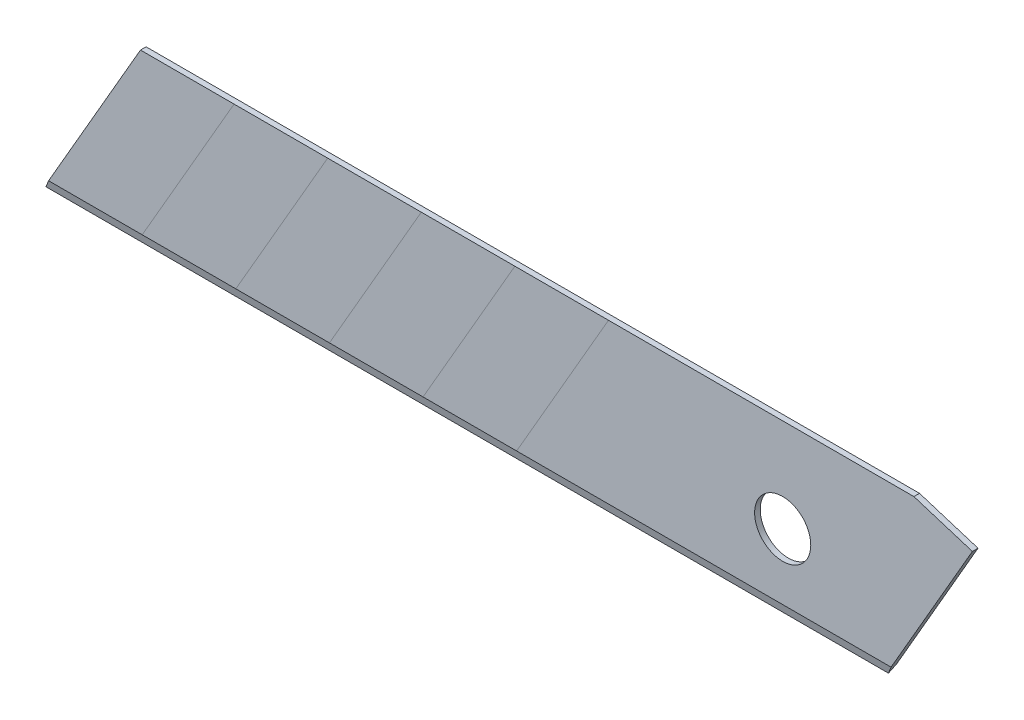
ISO-10303-21;
HEADER;
FILE_DESCRIPTION(('STEP AP214'),'2;1');
FILE_NAME('part.step','',(''),(''),'','','');
FILE_SCHEMA(('AUTOMOTIVE_DESIGN { 1 0 10303 214 1 1 1 1 }'));
ENDSEC;
DATA;
#1=APPLICATION_CONTEXT('core data for automotive mechanical design processes');
#2=APPLICATION_PROTOCOL_DEFINITION('international standard','automotive_design',2000,#1);
#3=PRODUCT_CONTEXT('',#1,'mechanical');
#4=PRODUCT('Part','Part','',(#3));
#5=PRODUCT_RELATED_PRODUCT_CATEGORY('part','',(#4));
#6=PRODUCT_DEFINITION_FORMATION('','',#4);
#7=PRODUCT_DEFINITION_CONTEXT('part definition',#1,'design');
#8=PRODUCT_DEFINITION('design','',#6,#7);
#9=PRODUCT_DEFINITION_SHAPE('','',#8);
#10=(LENGTH_UNIT() NAMED_UNIT(*) SI_UNIT(.MILLI.,.METRE.));
#11=(NAMED_UNIT(*) PLANE_ANGLE_UNIT() SI_UNIT($,.RADIAN.));
#12=(NAMED_UNIT(*) SI_UNIT($,.STERADIAN.) SOLID_ANGLE_UNIT());
#13=UNCERTAINTY_MEASURE_WITH_UNIT(LENGTH_MEASURE(1.E-05),#10,'distance_accuracy_value','');
#14=(GEOMETRIC_REPRESENTATION_CONTEXT(3) GLOBAL_UNCERTAINTY_ASSIGNED_CONTEXT((#13)) GLOBAL_UNIT_ASSIGNED_CONTEXT((#10,
#11,#12)) REPRESENTATION_CONTEXT('',''));
#15=CARTESIAN_POINT('',(0.,0.,0.));
#16=DIRECTION('',(0.,0.,1.));
#17=DIRECTION('',(1.,0.,0.));
#18=AXIS2_PLACEMENT_3D('',#15,#16,#17);
#19=CARTESIAN_POINT('',(-70.7283011839796,15.6445712955346,-0.15));
#20=DIRECTION('',(0.,0.,1.));
#21=DIRECTION('',(1.,0.,0.));
#22=AXIS2_PLACEMENT_3D('',#19,#20,#21);
#23=PLANE('',#22);
#24=DIRECTION('',(0.499999999999999,0.866025403784439,0.));
#25=VECTOR('',#24,1.);
#26=CARTESIAN_POINT('',(-23.8007264018009,-11.4490766373724,-0.15));
#27=LINE('',#26,#25);
#28=CARTESIAN_POINT('',(-19.211324865405,-3.49999999999999,-0.15));
#29=VERTEX_POINT('',#28);
#30=CARTESIAN_POINT('',(-14.3038475772932,5.,-0.15));
#31=VERTEX_POINT('',#30);
#32=EDGE_CURVE('E59',#29,#31,#27,.T.);
#33=ORIENTED_EDGE('',*,*,#32,.F.);
#34=DIRECTION('',(-1.,0.,0.));
#35=VECTOR('',#34,1.);
#36=CARTESIAN_POINT('',(13.,-3.5,-0.15));
#37=LINE('',#36,#35);
#38=CARTESIAN_POINT('',(-24.211324865405,-3.49999999999999,-0.15));
#39=VERTEX_POINT('',#38);
#40=EDGE_CURVE('E384',#29,#39,#37,.T.);
#41=ORIENTED_EDGE('',*,*,#40,.T.);
#42=DIRECTION('',(0.499999999999999,0.866025403784439,0.));
#43=VECTOR('',#42,1.);
#44=CARTESIAN_POINT('',(-27.5507264018009,-9.28401312791136,-0.15));
#45=LINE('',#44,#43);
#46=CARTESIAN_POINT('',(-19.3038475772932,5.,-0.15));
#47=VERTEX_POINT('',#46);
#48=EDGE_CURVE('E222',#39,#47,#45,.T.);
#49=ORIENTED_EDGE('',*,*,#48,.T.);
#50=DIRECTION('',(-1.,0.,0.));
#51=VECTOR('',#50,1.);
#52=CARTESIAN_POINT('',(-65.9878692661466,5.,-0.15));
#53=LINE('',#52,#51);
#54=EDGE_CURVE('E325',#31,#47,#53,.T.);
#55=ORIENTED_EDGE('',*,*,#54,.F.);
#56=EDGE_LOOP('',(#33,#41,#49,#55));
#57=FACE_BOUND('',#56,.T.);
#58=ADVANCED_FACE('F50',(#57),#23,.F.);
#59=ORIENTED_EDGE('',*,*,#48,.F.);
#60=CARTESIAN_POINT('',(-29.211324865405,-3.49999999999999,-0.15));
#61=VERTEX_POINT('',#60);
#62=EDGE_CURVE('E390',#39,#61,#37,.T.);
#63=ORIENTED_EDGE('',*,*,#62,.T.);
#64=DIRECTION('',(0.499999999999999,0.866025403784439,0.));
#65=VECTOR('',#64,1.);
#66=CARTESIAN_POINT('',(-31.3007264018009,-7.11894961845024,-0.15));
#67=LINE('',#66,#65);
#68=CARTESIAN_POINT('',(-24.3038475772932,5.,-0.15));
#69=VERTEX_POINT('',#68);
#70=EDGE_CURVE('E218',#61,#69,#67,.T.);
#71=ORIENTED_EDGE('',*,*,#70,.T.);
#72=EDGE_CURVE('E332',#47,#69,#53,.T.);
#73=ORIENTED_EDGE('',*,*,#72,.F.);
#74=EDGE_LOOP('',(#59,#63,#71,#73));
#75=FACE_BOUND('',#74,.T.);
#76=ADVANCED_FACE('F425',(#75),#23,.F.);
#77=ORIENTED_EDGE('',*,*,#70,.F.);
#78=CARTESIAN_POINT('',(-34.211324865405,-3.5,-0.15));
#79=VERTEX_POINT('',#78);
#80=EDGE_CURVE('E393',#61,#79,#37,.T.);
#81=ORIENTED_EDGE('',*,*,#80,.T.);
#82=DIRECTION('',(0.499999999999999,0.866025403784439,0.));
#83=VECTOR('',#82,1.);
#84=CARTESIAN_POINT('',(-35.050726401801,-4.95388610898914,-0.15));
#85=LINE('',#84,#83);
#86=CARTESIAN_POINT('',(-29.3038475772932,5.,-0.15));
#87=VERTEX_POINT('',#86);
#88=EDGE_CURVE('E214',#79,#87,#85,.T.);
#89=ORIENTED_EDGE('',*,*,#88,.T.);
#90=EDGE_CURVE('E335',#69,#87,#53,.T.);
#91=ORIENTED_EDGE('',*,*,#90,.F.);
#92=EDGE_LOOP('',(#77,#81,#89,#91));
#93=FACE_BOUND('',#92,.T.);
#94=ADVANCED_FACE('F419',(#93),#23,.F.);
#95=ORIENTED_EDGE('',*,*,#88,.F.);
#96=CARTESIAN_POINT('',(-39.2113248654052,-3.5,-0.15));
#97=VERTEX_POINT('',#96);
#98=EDGE_CURVE('E387',#79,#97,#37,.T.);
#99=ORIENTED_EDGE('',*,*,#98,.T.);
#100=DIRECTION('',(0.499999999999999,0.866025403784439,0.));
#101=VECTOR('',#100,1.);
#102=CARTESIAN_POINT('',(-38.800726401801,-2.78882259952805,-0.15));
#103=LINE('',#102,#101);
#104=CARTESIAN_POINT('',(-34.3038475772934,5.,-0.15));
#105=VERTEX_POINT('',#104);
#106=EDGE_CURVE('E210',#97,#105,#103,.T.);
#107=ORIENTED_EDGE('',*,*,#106,.T.);
#108=EDGE_CURVE('E329',#87,#105,#53,.T.);
#109=ORIENTED_EDGE('',*,*,#108,.F.);
#110=EDGE_LOOP('',(#95,#99,#107,#109));
#111=FACE_BOUND('',#110,.T.);
#112=ADVANCED_FACE('F415',(#111),#23,.F.);
#113=CARTESIAN_POINT('',(-14.211324865405,-3.5,-0.15));
#114=VERTEX_POINT('',#113);
#115=EDGE_CURVE('E382',#114,#29,#37,.T.);
#116=ORIENTED_EDGE('',*,*,#115,.T.);
#117=ORIENTED_EDGE('',*,*,#32,.T.);
#118=CARTESIAN_POINT('',(-9.30384757729341,5.,-0.15));
#119=VERTEX_POINT('',#118);
#120=EDGE_CURVE('E323',#119,#31,#53,.T.);
#121=ORIENTED_EDGE('',*,*,#120,.F.);
#122=DIRECTION('',(0.49999999999998,0.86602540378445,0.));
#123=VECTOR('',#122,1.);
#124=CARTESIAN_POINT('',(-20.0507264018001,-13.6141401468326,-0.15));
#125=LINE('',#124,#123);
#126=EDGE_CURVE('E207',#114,#119,#125,.T.);
#127=ORIENTED_EDGE('',*,*,#126,.F.);
#128=EDGE_LOOP('',(#116,#117,#121,#127));
#129=FACE_BOUND('',#128,.T.);
#130=ADVANCED_FACE('F429',(#129),#23,.F.);
#131=CARTESIAN_POINT('',(-70.7283011839796,15.6445712955346,0.15));
#132=DIRECTION('',(0.,0.,1.));
#133=DIRECTION('',(1.,0.,0.));
#134=AXIS2_PLACEMENT_3D('',#131,#132,#133);
#135=PLANE('',#134);
#136=DIRECTION('',(-1.,0.,0.));
#137=VECTOR('',#136,1.);
#138=CARTESIAN_POINT('',(13.,-3.5,0.15));
#139=LINE('',#138,#137);
#140=CARTESIAN_POINT('',(-19.2113248654052,-3.49999999999999,0.15));
#141=VERTEX_POINT('',#140);
#142=CARTESIAN_POINT('',(-24.2113248654052,-3.49999999999999,0.15));
#143=VERTEX_POINT('',#142);
#144=EDGE_CURVE('E367',#141,#143,#139,.T.);
#145=ORIENTED_EDGE('',*,*,#144,.F.);
#146=DIRECTION('',(0.5,0.866025403784439,0.));
#147=VECTOR('',#146,1.);
#148=CARTESIAN_POINT('',(-23.8007264018011,-11.4490766373724,0.15));
#149=LINE('',#148,#147);
#150=CARTESIAN_POINT('',(-14.3038475772934,5.,0.15));
#151=VERTEX_POINT('',#150);
#152=EDGE_CURVE('E204',#141,#151,#149,.T.);
#153=ORIENTED_EDGE('',*,*,#152,.T.);
#154=DIRECTION('',(-1.,0.,0.));
#155=VECTOR('',#154,1.);
#156=CARTESIAN_POINT('',(-65.9878692661466,5.,0.15));
#157=LINE('',#156,#155);
#158=CARTESIAN_POINT('',(-19.3038475772934,5.,0.15));
#159=VERTEX_POINT('',#158);
#160=EDGE_CURVE('E297',#151,#159,#157,.T.);
#161=ORIENTED_EDGE('',*,*,#160,.T.);
#162=DIRECTION('',(0.500000000000001,0.866025403784438,0.));
#163=VECTOR('',#162,1.);
#164=CARTESIAN_POINT('',(-27.5507264018012,-9.28401312791132,0.15));
#165=LINE('',#164,#163);
#166=EDGE_CURVE('E200',#143,#159,#165,.T.);
#167=ORIENTED_EDGE('',*,*,#166,.F.);
#168=EDGE_LOOP('',(#145,#153,#161,#167));
#169=FACE_BOUND('',#168,.T.);
#170=ADVANCED_FACE('F456',(#169),#135,.T.);
#171=CARTESIAN_POINT('',(-29.2113248654052,-3.49999999999999,0.15));
#172=VERTEX_POINT('',#171);
#173=EDGE_CURVE('E373',#143,#172,#139,.T.);
#174=ORIENTED_EDGE('',*,*,#173,.F.);
#175=ORIENTED_EDGE('',*,*,#166,.T.);
#176=CARTESIAN_POINT('',(-24.3038475772934,5.,0.15));
#177=VERTEX_POINT('',#176);
#178=EDGE_CURVE('E303',#159,#177,#157,.T.);
#179=ORIENTED_EDGE('',*,*,#178,.T.);
#180=DIRECTION('',(0.500000000000001,0.866025403784438,0.));
#181=VECTOR('',#180,1.);
#182=CARTESIAN_POINT('',(-31.3007264018011,-7.11894961845023,0.15));
#183=LINE('',#182,#181);
#184=EDGE_CURVE('E191',#172,#177,#183,.T.);
#185=ORIENTED_EDGE('',*,*,#184,.F.);
#186=EDGE_LOOP('',(#174,#175,#179,#185));
#187=FACE_BOUND('',#186,.T.);
#188=ADVANCED_FACE('F461',(#187),#135,.T.);
#189=CARTESIAN_POINT('',(-34.2113248654052,-3.5,0.15));
#190=VERTEX_POINT('',#189);
#191=EDGE_CURVE('E171',#172,#190,#139,.T.);
#192=ORIENTED_EDGE('',*,*,#191,.F.);
#193=ORIENTED_EDGE('',*,*,#184,.T.);
#194=CARTESIAN_POINT('',(-29.3038475772934,5.,0.15));
#195=VERTEX_POINT('',#194);
#196=EDGE_CURVE('E306',#177,#195,#157,.T.);
#197=ORIENTED_EDGE('',*,*,#196,.T.);
#198=DIRECTION('',(0.5,0.866025403784439,0.));
#199=VECTOR('',#198,1.);
#200=CARTESIAN_POINT('',(-35.0507264018011,-4.95388610898912,0.15));
#201=LINE('',#200,#199);
#202=EDGE_CURVE('E184',#190,#195,#201,.T.);
#203=ORIENTED_EDGE('',*,*,#202,.F.);
#204=EDGE_LOOP('',(#192,#193,#197,#203));
#205=FACE_BOUND('',#204,.T.);
#206=ADVANCED_FACE('F463',(#205),#135,.T.);
#207=CARTESIAN_POINT('',(-39.2113248654052,-3.5,0.15));
#208=VERTEX_POINT('',#207);
#209=EDGE_CURVE('E168',#190,#208,#139,.T.);
#210=ORIENTED_EDGE('',*,*,#209,.F.);
#211=ORIENTED_EDGE('',*,*,#202,.T.);
#212=CARTESIAN_POINT('',(-34.3038475772934,5.,0.15));
#213=VERTEX_POINT('',#212);
#214=EDGE_CURVE('E182',#195,#213,#157,.T.);
#215=ORIENTED_EDGE('',*,*,#214,.T.);
#216=DIRECTION('',(0.5,0.866025403784439,0.));
#217=VECTOR('',#216,1.);
#218=CARTESIAN_POINT('',(-38.8007264018011,-2.78882259952802,0.15));
#219=LINE('',#218,#217);
#220=EDGE_CURVE('E163',#208,#213,#219,.T.);
#221=ORIENTED_EDGE('',*,*,#220,.F.);
#222=EDGE_LOOP('',(#210,#211,#215,#221));
#223=FACE_BOUND('',#222,.T.);
#224=ADVANCED_FACE('F180',(#223),#135,.T.);
#225=ORIENTED_EDGE('',*,*,#152,.F.);
#226=CARTESIAN_POINT('',(-14.2113248654052,-3.5,0.15));
#227=VERTEX_POINT('',#226);
#228=EDGE_CURVE('E178',#227,#141,#139,.T.);
#229=ORIENTED_EDGE('',*,*,#228,.F.);
#230=DIRECTION('',(0.5,0.866025403784438,0.));
#231=VECTOR('',#230,1.);
#232=CARTESIAN_POINT('',(-20.0507264018012,-13.6141401468335,0.15));
#233=LINE('',#232,#231);
#234=CARTESIAN_POINT('',(-9.30384757729341,5.,0.15));
#235=VERTEX_POINT('',#234);
#236=EDGE_CURVE('E185',#227,#235,#233,.T.);
#237=ORIENTED_EDGE('',*,*,#236,.T.);
#238=EDGE_CURVE('E295',#235,#151,#157,.T.);
#239=ORIENTED_EDGE('',*,*,#238,.T.);
#240=EDGE_LOOP('',(#225,#229,#237,#239));
#241=FACE_BOUND('',#240,.T.);
#242=ADVANCED_FACE('F452',(#241),#135,.T.);
#243=ORIENTED_EDGE('',*,*,#236,.F.);
#244=CARTESIAN_POINT('',(5.78867513459481,-3.5,0.15));
#245=VERTEX_POINT('',#244);
#246=EDGE_CURVE('E362',#245,#227,#139,.T.);
#247=ORIENTED_EDGE('',*,*,#246,.F.);
#248=DIRECTION('',(0.499999999999998,0.86602540378444,0.));
#249=VECTOR('',#248,1.);
#250=CARTESIAN_POINT('',(5.5,-4.,0.15));
#251=LINE('',#250,#249);
#252=CARTESIAN_POINT('',(10.1326672819298,4.02401510686452,0.15));
#253=VERTEX_POINT('',#252);
#254=EDGE_CURVE('E314',#245,#253,#251,.T.);
#255=ORIENTED_EDGE('',*,*,#254,.T.);
#256=DIRECTION('',(-0.954490474813964,0.298241401367104,0.));
#257=VECTOR('',#256,1.);
#258=CARTESIAN_POINT('',(7.00912950417686,5.,0.15));
#259=LINE('',#258,#257);
#260=CARTESIAN_POINT('',(7.00912950417686,5.,0.15));
#261=VERTEX_POINT('',#260);
#262=EDGE_CURVE('E311',#253,#261,#259,.T.);
#263=ORIENTED_EDGE('',*,*,#262,.T.);
#264=EDGE_CURVE('E290',#261,#235,#157,.T.);
#265=ORIENTED_EDGE('',*,*,#264,.T.);
#266=EDGE_LOOP('',(#243,#247,#255,#263,#265));
#267=FACE_BOUND('',#266,.T.);
#268=CARTESIAN_POINT('',(0.,0.,0.15));
#269=DIRECTION('',(0.,0.,1.));
#270=DIRECTION('',(1.,0.,0.));
#271=AXIS2_PLACEMENT_3D('',#268,#269,#270);
#272=CIRCLE('',#271,1.5);
#273=CARTESIAN_POINT('',(1.5,0.,0.15));
#274=VERTEX_POINT('',#273);
#275=EDGE_CURVE('E348',#274,#274,#272,.T.);
#276=ORIENTED_EDGE('',*,*,#275,.F.);
#277=EDGE_LOOP('',(#276));
#278=FACE_BOUND('',#277,.T.);
#279=ADVANCED_FACE('F445',(#267,#278),#135,.T.);
#280=CARTESIAN_POINT('',(0.,0.,-0.15));
#281=DIRECTION('',(0.,0.,1.));
#282=DIRECTION('',(1.,0.,0.));
#283=AXIS2_PLACEMENT_3D('',#280,#281,#282);
#284=CIRCLE('',#283,1.5);
#285=CARTESIAN_POINT('',(1.5,0.,-0.15));
#286=VERTEX_POINT('',#285);
#287=EDGE_CURVE('E353',#286,#286,#284,.T.);
#288=ORIENTED_EDGE('',*,*,#287,.T.);
#289=EDGE_LOOP('',(#288));
#290=FACE_BOUND('',#289,.T.);
#291=CARTESIAN_POINT('',(5.78867513459481,-3.5,-0.15));
#292=VERTEX_POINT('',#291);
#293=EDGE_CURVE('E176',#292,#114,#37,.T.);
#294=ORIENTED_EDGE('',*,*,#293,.T.);
#295=ORIENTED_EDGE('',*,*,#126,.T.);
#296=CARTESIAN_POINT('',(7.00912950417686,5.,-0.15));
#297=VERTEX_POINT('',#296);
#298=EDGE_CURVE('E318',#297,#119,#53,.T.);
#299=ORIENTED_EDGE('',*,*,#298,.F.);
#300=DIRECTION('',(-0.954490474813964,0.298241401367104,0.));
#301=VECTOR('',#300,1.);
#302=CARTESIAN_POINT('',(7.00912950417686,5.,-0.15));
#303=LINE('',#302,#301);
#304=CARTESIAN_POINT('',(10.1326672819298,4.02401510686452,-0.15));
#305=VERTEX_POINT('',#304);
#306=EDGE_CURVE('E341',#305,#297,#303,.T.);
#307=ORIENTED_EDGE('',*,*,#306,.F.);
#308=DIRECTION('',(0.499999999999998,0.86602540378444,0.));
#309=VECTOR('',#308,1.);
#310=CARTESIAN_POINT('',(5.5,-4.,-0.15));
#311=LINE('',#310,#309);
#312=EDGE_CURVE('E344',#292,#305,#311,.T.);
#313=ORIENTED_EDGE('',*,*,#312,.F.);
#314=EDGE_LOOP('',(#294,#295,#299,#307,#313));
#315=FACE_BOUND('',#314,.T.);
#316=ADVANCED_FACE('F433',(#290,#315),#23,.F.);
#317=CARTESIAN_POINT('',(5.5,-4.,0.15));
#318=DIRECTION('',(-0.86602540378444,0.499999999999998,0.));
#319=DIRECTION('',(-0.499999999999998,-0.86602540378444,0.));
#320=AXIS2_PLACEMENT_3D('',#317,#318,#319);
#321=PLANE('',#320);
#322=DIRECTION('',(-0.483933918495825,-0.83819813434067,0.251459440302201));
#323=VECTOR('',#322,1.);
#324=CARTESIAN_POINT('',(5.48174653715677,-4.03161592505855,0.00948477751756444));
#325=LINE('',#324,#323);
#326=CARTESIAN_POINT('',(5.5,-4.,0.));
#327=VERTEX_POINT('',#326);
#328=EDGE_CURVE('E193',#292,#327,#325,.T.);
#329=ORIENTED_EDGE('',*,*,#328,.F.);
#330=ORIENTED_EDGE('',*,*,#312,.T.);
#331=DIRECTION('',(0.,0.,-1.));
#332=VECTOR('',#331,1.);
#333=CARTESIAN_POINT('',(10.1326672819298,4.02401510686452,0.15));
#334=LINE('',#333,#332);
#335=EDGE_CURVE('E280',#253,#305,#334,.T.);
#336=ORIENTED_EDGE('',*,*,#335,.F.);
#337=ORIENTED_EDGE('',*,*,#254,.F.);
#338=DIRECTION('',(0.483933918495825,0.83819813434067,0.251459440302201));
#339=VECTOR('',#338,1.);
#340=CARTESIAN_POINT('',(5.51825346284323,-3.96838407494145,0.00948477751756442));
#341=LINE('',#340,#339);
#342=EDGE_CURVE('E277',#327,#245,#341,.T.);
#343=ORIENTED_EDGE('',*,*,#342,.F.);
#344=EDGE_LOOP('',(#329,#330,#336,#337,#343));
#345=FACE_BOUND('',#344,.T.);
#346=ADVANCED_FACE('F52',(#345),#321,.F.);
#347=CARTESIAN_POINT('',(7.00912950417686,5.,0.15));
#348=DIRECTION('',(-0.298241401367104,-0.954490474813964,0.));
#349=DIRECTION('',(0.954490474813964,-0.298241401367104,0.));
#350=AXIS2_PLACEMENT_3D('',#347,#348,#349);
#351=PLANE('',#350);
#352=ORIENTED_EDGE('',*,*,#306,.T.);
#353=DIRECTION('',(0.,0.,-1.));
#354=VECTOR('',#353,1.);
#355=CARTESIAN_POINT('',(7.00912950417686,5.,0.15));
#356=LINE('',#355,#354);
#357=EDGE_CURVE('E285',#261,#297,#356,.T.);
#358=ORIENTED_EDGE('',*,*,#357,.F.);
#359=ORIENTED_EDGE('',*,*,#262,.F.);
#360=ORIENTED_EDGE('',*,*,#335,.T.);
#361=EDGE_LOOP('',(#352,#358,#359,#360));
#362=FACE_BOUND('',#361,.T.);
#363=ADVANCED_FACE('F441',(#362),#351,.F.);
#364=CARTESIAN_POINT('',(-65.9878692661466,5.,0.15));
#365=DIRECTION('',(0.,-1.,0.));
#366=DIRECTION('',(0.,0.,-1.));
#367=AXIS2_PLACEMENT_3D('',#364,#365,#366);
#368=PLANE('',#367);
#369=ORIENTED_EDGE('',*,*,#108,.T.);
#370=DIRECTION('',(0.,0.,1.));
#371=VECTOR('',#370,1.);
#372=CARTESIAN_POINT('',(-34.3038475772934,5.,0.15));
#373=LINE('',#372,#371);
#374=EDGE_CURVE('E399',#105,#213,#373,.T.);
#375=ORIENTED_EDGE('',*,*,#374,.T.);
#376=ORIENTED_EDGE('',*,*,#214,.F.);
#377=ORIENTED_EDGE('',*,*,#196,.F.);
#378=ORIENTED_EDGE('',*,*,#178,.F.);
#379=ORIENTED_EDGE('',*,*,#160,.F.);
#380=ORIENTED_EDGE('',*,*,#238,.F.);
#381=ORIENTED_EDGE('',*,*,#264,.F.);
#382=ORIENTED_EDGE('',*,*,#357,.T.);
#383=ORIENTED_EDGE('',*,*,#298,.T.);
#384=ORIENTED_EDGE('',*,*,#120,.T.);
#385=ORIENTED_EDGE('',*,*,#54,.T.);
#386=ORIENTED_EDGE('',*,*,#72,.T.);
#387=ORIENTED_EDGE('',*,*,#90,.T.);
#388=EDGE_LOOP('',(#369,#375,#376,#377,#378,#379,#380,#381,#382,#383,#384,#385,#386,#387));
#389=FACE_BOUND('',#388,.T.);
#390=ADVANCED_FACE('F406',(#389),#368,.F.);
#391=CARTESIAN_POINT('',(0.,0.,0.15));
#392=DIRECTION('',(0.,0.,-1.));
#393=DIRECTION('',(-1.,0.,0.));
#394=AXIS2_PLACEMENT_3D('',#391,#392,#393);
#395=CYLINDRICAL_SURFACE('',#394,1.5);
#396=ORIENTED_EDGE('',*,*,#275,.T.);
#397=EDGE_LOOP('',(#396));
#398=FACE_BOUND('',#397,.T.);
#399=ORIENTED_EDGE('',*,*,#287,.F.);
#400=EDGE_LOOP('',(#399));
#401=FACE_BOUND('',#400,.T.);
#402=ADVANCED_FACE('F554',(#398,#401),#395,.F.);
#403=CARTESIAN_POINT('',(13.,-4.,0.));
#404=DIRECTION('',(0.,-0.287347885566345,-0.957826285221151));
#405=DIRECTION('',(0.,0.957826285221151,-0.287347885566345));
#406=AXIS2_PLACEMENT_3D('',#403,#404,#405);
#407=PLANE('',#406);
#408=DIRECTION('',(-0.483933918495827,-0.838198134340669,0.251459440302201));
#409=VECTOR('',#408,1.);
#410=CARTESIAN_POINT('',(-27.2049180327869,17.295706650437,-6.38871199513111));
#411=LINE('',#410,#409);
#412=CARTESIAN_POINT('',(-39.5,-4.,0.));
#413=VERTEX_POINT('',#412);
#414=EDGE_CURVE('E65',#97,#413,#411,.T.);
#415=ORIENTED_EDGE('',*,*,#414,.F.);
#416=ORIENTED_EDGE('',*,*,#98,.F.);
#417=ORIENTED_EDGE('',*,*,#80,.F.);
#418=ORIENTED_EDGE('',*,*,#62,.F.);
#419=ORIENTED_EDGE('',*,*,#40,.F.);
#420=ORIENTED_EDGE('',*,*,#115,.F.);
#421=ORIENTED_EDGE('',*,*,#293,.F.);
#422=ORIENTED_EDGE('',*,*,#328,.T.);
#423=DIRECTION('',(-1.,0.,0.));
#424=VECTOR('',#423,1.);
#425=CARTESIAN_POINT('',(13.,-4.,0.));
#426=LINE('',#425,#424);
#427=EDGE_CURVE('E358',#327,#413,#426,.T.);
#428=ORIENTED_EDGE('',*,*,#427,.T.);
#429=EDGE_LOOP('',(#415,#416,#417,#418,#419,#420,#421,#422,#428));
#430=FACE_BOUND('',#429,.T.);
#431=ADVANCED_FACE('F412',(#430),#407,.T.);
#432=CARTESIAN_POINT('',(13.,-4.,0.));
#433=DIRECTION('',(0.,-0.287347885566345,0.957826285221152));
#434=DIRECTION('',(0.,-0.957826285221152,-0.287347885566345));
#435=AXIS2_PLACEMENT_3D('',#432,#433,#434);
#436=PLANE('',#435);
#437=DIRECTION('',(0.483933918495827,0.838198134340669,0.2514594403022));
#438=VECTOR('',#437,1.);
#439=CARTESIAN_POINT('',(-27.2049180327869,17.295706650437,6.3887119951311));
#440=LINE('',#439,#438);
#441=EDGE_CURVE('E11',#413,#208,#440,.T.);
#442=ORIENTED_EDGE('',*,*,#441,.F.);
#443=ORIENTED_EDGE('',*,*,#427,.F.);
#444=ORIENTED_EDGE('',*,*,#342,.T.);
#445=ORIENTED_EDGE('',*,*,#246,.T.);
#446=ORIENTED_EDGE('',*,*,#228,.T.);
#447=ORIENTED_EDGE('',*,*,#144,.T.);
#448=ORIENTED_EDGE('',*,*,#173,.T.);
#449=ORIENTED_EDGE('',*,*,#191,.T.);
#450=ORIENTED_EDGE('',*,*,#209,.T.);
#451=EDGE_LOOP('',(#442,#443,#444,#445,#446,#447,#448,#449,#450));
#452=FACE_BOUND('',#451,.T.);
#453=ADVANCED_FACE('F169',(#452),#436,.T.);
#454=CARTESIAN_POINT('',(-30.4763636028938,11.6293967088157,-0.15));
#455=DIRECTION('',(0.866025403784439,-0.5,0.));
#456=DIRECTION('',(0.5,0.866025403784439,0.));
#457=AXIS2_PLACEMENT_3D('',#454,#455,#456);
#458=PLANE('',#457);
#459=ORIENTED_EDGE('',*,*,#106,.F.);
#460=ORIENTED_EDGE('',*,*,#414,.T.);
#461=ORIENTED_EDGE('',*,*,#441,.T.);
#462=ORIENTED_EDGE('',*,*,#220,.T.);
#463=ORIENTED_EDGE('',*,*,#374,.F.);
#464=EDGE_LOOP('',(#459,#460,#461,#462,#463));
#465=FACE_BOUND('',#464,.T.);
#466=ADVANCED_FACE('F161',(#465),#458,.F.);
#467=CLOSED_SHELL('',(#58,#76,#94,#112,#130,#170,#188,#206,#224,#242,#279,#316,#346,#363,#390,
#402,#431,#453,#466));
#468=MANIFOLD_SOLID_BREP('B2',#467);
#469=ADVANCED_BREP_SHAPE_REPRESENTATION('',(#18,#468),#14);
#470=SHAPE_DEFINITION_REPRESENTATION(#9,#469);
ENDSEC;
END-ISO-10303-21;
